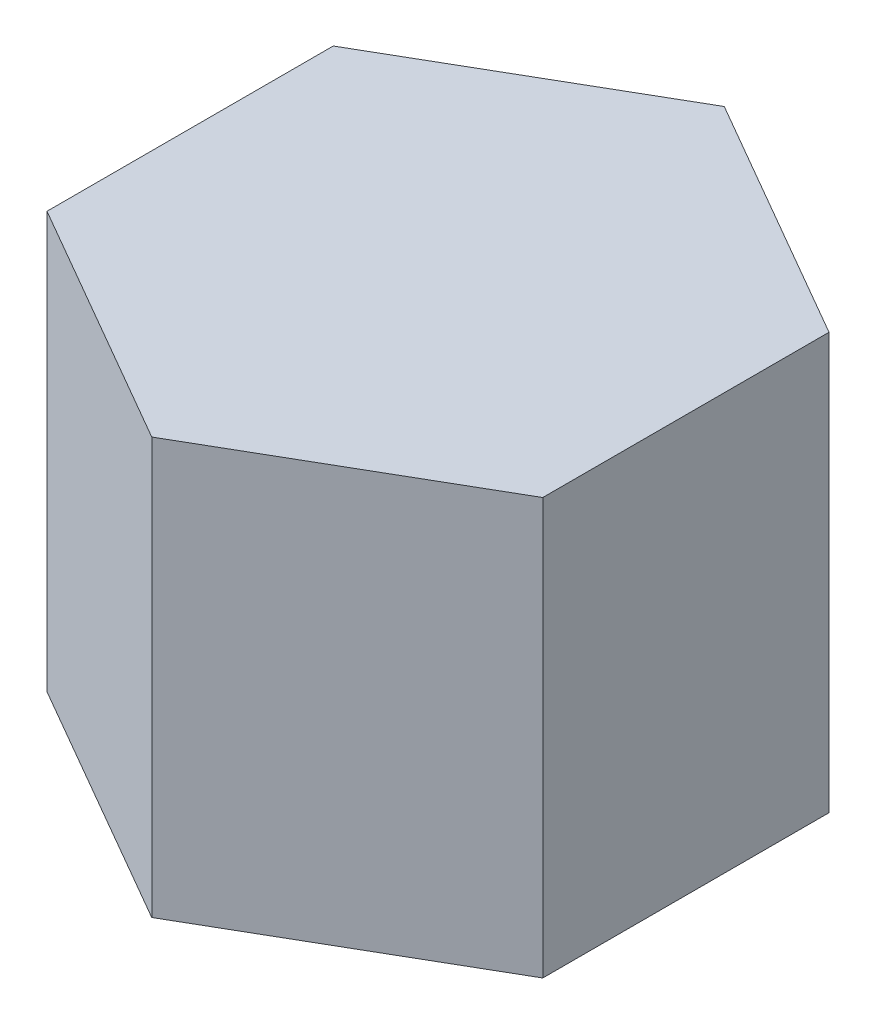
ISO-10303-21;
HEADER;
FILE_DESCRIPTION(('STEP AP214'),'2;1');
FILE_NAME('part.step','',(''),(''),'','','');
FILE_SCHEMA(('AUTOMOTIVE_DESIGN { 1 0 10303 214 1 1 1 1 }'));
ENDSEC;
DATA;
#1=APPLICATION_CONTEXT('core data for automotive mechanical design processes');
#2=APPLICATION_PROTOCOL_DEFINITION('international standard','automotive_design',2000,#1);
#3=PRODUCT_CONTEXT('',#1,'mechanical');
#4=PRODUCT('Part','Part','',(#3));
#5=PRODUCT_RELATED_PRODUCT_CATEGORY('part','',(#4));
#6=PRODUCT_DEFINITION_FORMATION('','',#4);
#7=PRODUCT_DEFINITION_CONTEXT('part definition',#1,'design');
#8=PRODUCT_DEFINITION('design','',#6,#7);
#9=PRODUCT_DEFINITION_SHAPE('','',#8);
#10=(LENGTH_UNIT() NAMED_UNIT(*) SI_UNIT(.MILLI.,.METRE.));
#11=(NAMED_UNIT(*) PLANE_ANGLE_UNIT() SI_UNIT($,.RADIAN.));
#12=(NAMED_UNIT(*) SI_UNIT($,.STERADIAN.) SOLID_ANGLE_UNIT());
#13=UNCERTAINTY_MEASURE_WITH_UNIT(LENGTH_MEASURE(1.E-05),#10,'distance_accuracy_value','');
#14=(GEOMETRIC_REPRESENTATION_CONTEXT(3) GLOBAL_UNCERTAINTY_ASSIGNED_CONTEXT((#13)) GLOBAL_UNIT_ASSIGNED_CONTEXT((#10,
#11,#12)) REPRESENTATION_CONTEXT('',''));
#15=CARTESIAN_POINT('',(0.,0.,0.));
#16=DIRECTION('',(0.,0.,1.));
#17=DIRECTION('',(1.,0.,0.));
#18=AXIS2_PLACEMENT_3D('',#15,#16,#17);
#19=CARTESIAN_POINT('',(207.839551417381,-147.556598747966,296.012098239417));
#20=DIRECTION('',(-0.500000000000062,0.,-0.866025403784403));
#21=DIRECTION('',(-0.866025403784403,0.,0.500000000000062));
#22=AXIS2_PLACEMENT_3D('',#19,#20,#21);
#23=PLANE('',#22);
#24=CARTESIAN_POINT('',(208.142660308706,-147.047793579175,295.837098239417));
#25=DIRECTION('',(-0.866025403784403,0.,0.500000000000062));
#26=VECTOR('',#25,1.);
#27=LINE('',#24,#26);
#28=CARTESIAN_POINT('',(208.142660308706,-147.047793579175,295.837098239417));
#29=VERTEX_POINT('',#28);
#30=CARTESIAN_POINT('',(207.839551417382,-147.047793579175,296.012098239417));
#31=VERTEX_POINT('',#30);
#32=EDGE_CURVE('E170',#29,#31,#27,.T.);
#33=ORIENTED_EDGE('',*,*,#32,.T.);
#34=CARTESIAN_POINT('',(207.839551417382,-147.556598747966,296.012098239417));
#35=DIRECTION('',(0.,1.,0.));
#36=VECTOR('',#35,1.);
#37=LINE('',#34,#36);
#38=CARTESIAN_POINT('',(207.839551417382,-147.556598747966,296.012098239417));
#39=VERTEX_POINT('',#38);
#40=EDGE_CURVE('E35',#39,#31,#37,.T.);
#41=ORIENTED_EDGE('',*,*,#40,.F.);
#42=CARTESIAN_POINT('',(208.142660308706,-147.556598747966,295.837098239417));
#43=DIRECTION('',(-0.866025403784403,0.,0.500000000000062));
#44=VECTOR('',#43,1.);
#45=LINE('',#42,#44);
#46=CARTESIAN_POINT('',(208.142660308706,-147.556598747966,295.837098239417));
#47=VERTEX_POINT('',#46);
#48=EDGE_CURVE('E159',#47,#39,#45,.T.);
#49=ORIENTED_EDGE('',*,*,#48,.F.);
#50=CARTESIAN_POINT('',(208.142660308706,-147.556598747966,295.837098239417));
#51=DIRECTION('',(0.,1.,0.));
#52=VECTOR('',#51,1.);
#53=LINE('',#50,#52);
#54=EDGE_CURVE('E10',#47,#29,#53,.T.);
#55=ORIENTED_EDGE('',*,*,#54,.T.);
#56=EDGE_LOOP('',(#33,#41,#49,#55));
#57=FACE_BOUND('',#56,.T.);
#58=ADVANCED_FACE('F16',(#57),#23,.F.);
#59=CARTESIAN_POINT('',(208.142660308706,-147.556598747966,291.594471220494));
#60=DIRECTION('',(-1.,0.,0.));
#61=DIRECTION('',(0.,-1.,0.));
#62=AXIS2_PLACEMENT_3D('',#59,#60,#61);
#63=PLANE('',#62);
#64=CARTESIAN_POINT('',(208.142660308706,-147.047793579175,295.487098239417));
#65=DIRECTION('',(0.,0.,1.));
#66=VECTOR('',#65,1.);
#67=LINE('',#64,#66);
#68=CARTESIAN_POINT('',(208.142660308706,-147.047793579175,295.487098239417));
#69=VERTEX_POINT('',#68);
#70=EDGE_CURVE('E167',#69,#29,#67,.T.);
#71=ORIENTED_EDGE('',*,*,#70,.T.);
#72=ORIENTED_EDGE('',*,*,#54,.F.);
#73=CARTESIAN_POINT('',(208.142660308706,-147.556598747966,295.487098239417));
#74=DIRECTION('',(0.,0.,1.));
#75=VECTOR('',#74,1.);
#76=LINE('',#73,#75);
#77=CARTESIAN_POINT('',(208.142660308706,-147.556598747966,295.487098239417));
#78=VERTEX_POINT('',#77);
#79=EDGE_CURVE('E156',#78,#47,#76,.T.);
#80=ORIENTED_EDGE('',*,*,#79,.F.);
#81=CARTESIAN_POINT('',(208.142660308706,-147.556598747966,295.487098239417));
#82=DIRECTION('',(0.,1.,0.));
#83=VECTOR('',#82,1.);
#84=LINE('',#81,#83);
#85=EDGE_CURVE('E27',#78,#69,#84,.T.);
#86=ORIENTED_EDGE('',*,*,#85,.T.);
#87=EDGE_LOOP('',(#71,#72,#80,#86));
#88=FACE_BOUND('',#87,.T.);
#89=ADVANCED_FACE('F189',(#88),#63,.F.);
#90=CARTESIAN_POINT('',(208.142660308706,-147.556598747966,295.487098239417));
#91=DIRECTION('',(-0.500000000000012,0.,0.866025403784432));
#92=DIRECTION('',(0.866025403784432,0.,0.500000000000012));
#93=AXIS2_PLACEMENT_3D('',#90,#91,#92);
#94=PLANE('',#93);
#95=CARTESIAN_POINT('',(207.839551417382,-147.047793579175,295.312098239417));
#96=DIRECTION('',(0.866025403784432,0.,0.500000000000012));
#97=VECTOR('',#96,1.);
#98=LINE('',#95,#97);
#99=CARTESIAN_POINT('',(207.839551417382,-147.047793579175,295.312098239417));
#100=VERTEX_POINT('',#99);
#101=EDGE_CURVE('E163',#100,#69,#98,.T.);
#102=ORIENTED_EDGE('',*,*,#101,.T.);
#103=ORIENTED_EDGE('',*,*,#85,.F.);
#104=CARTESIAN_POINT('',(207.839551417382,-147.556598747966,295.312098239417));
#105=DIRECTION('',(0.866025403784432,0.,0.500000000000012));
#106=VECTOR('',#105,1.);
#107=LINE('',#104,#106);
#108=CARTESIAN_POINT('',(207.839551417382,-147.556598747966,295.312098239417));
#109=VERTEX_POINT('',#108);
#110=EDGE_CURVE('E106',#109,#78,#107,.T.);
#111=ORIENTED_EDGE('',*,*,#110,.F.);
#112=CARTESIAN_POINT('',(207.839551417382,-147.556598747966,295.312098239417));
#113=DIRECTION('',(0.,1.,0.));
#114=VECTOR('',#113,1.);
#115=LINE('',#112,#114);
#116=EDGE_CURVE('E94',#109,#100,#115,.T.);
#117=ORIENTED_EDGE('',*,*,#116,.T.);
#118=EDGE_LOOP('',(#102,#103,#111,#117));
#119=FACE_BOUND('',#118,.T.);
#120=ADVANCED_FACE('F198',(#119),#94,.F.);
#121=CARTESIAN_POINT('',(207.839551417382,-147.556598747966,295.312098239417));
#122=DIRECTION('',(0.499999999999978,0.,0.866025403784452));
#123=DIRECTION('',(0.866025403784452,0.,-0.499999999999978));
#124=AXIS2_PLACEMENT_3D('',#121,#122,#123);
#125=PLANE('',#124);
#126=CARTESIAN_POINT('',(207.536442526057,-147.047793579175,295.487098239417));
#127=DIRECTION('',(0.866025403784452,0.,-0.499999999999978));
#128=VECTOR('',#127,1.);
#129=LINE('',#126,#128);
#130=CARTESIAN_POINT('',(207.536442526057,-147.047793579175,295.487098239417));
#131=VERTEX_POINT('',#130);
#132=EDGE_CURVE('E162',#131,#100,#129,.T.);
#133=ORIENTED_EDGE('',*,*,#132,.T.);
#134=ORIENTED_EDGE('',*,*,#116,.F.);
#135=CARTESIAN_POINT('',(207.536442526057,-147.556598747966,295.487098239417));
#136=DIRECTION('',(0.866025403784452,0.,-0.499999999999978));
#137=VECTOR('',#136,1.);
#138=LINE('',#135,#137);
#139=CARTESIAN_POINT('',(207.536442526057,-147.556598747966,295.487098239417));
#140=VERTEX_POINT('',#139);
#141=EDGE_CURVE('E98',#140,#109,#138,.T.);
#142=ORIENTED_EDGE('',*,*,#141,.F.);
#143=CARTESIAN_POINT('',(207.536442526057,-147.556598747966,295.487098239417));
#144=DIRECTION('',(0.,1.,0.));
#145=VECTOR('',#144,1.);
#146=LINE('',#143,#145);
#147=EDGE_CURVE('E79',#140,#131,#146,.T.);
#148=ORIENTED_EDGE('',*,*,#147,.T.);
#149=EDGE_LOOP('',(#133,#134,#142,#148));
#150=FACE_BOUND('',#149,.T.);
#151=ADVANCED_FACE('F100',(#150),#125,.F.);
#152=CARTESIAN_POINT('',(207.536442526057,-147.556598747966,291.594471220494));
#153=DIRECTION('',(1.,0.,0.));
#154=DIRECTION('',(0.,1.,0.));
#155=AXIS2_PLACEMENT_3D('',#152,#153,#154);
#156=PLANE('',#155);
#157=CARTESIAN_POINT('',(207.536442526057,-147.047793579175,295.837098239417));
#158=DIRECTION('',(0.,0.,-1.));
#159=VECTOR('',#158,1.);
#160=LINE('',#157,#159);
#161=CARTESIAN_POINT('',(207.536442526057,-147.047793579175,295.837098239417));
#162=VERTEX_POINT('',#161);
#163=EDGE_CURVE('E88',#162,#131,#160,.T.);
#164=ORIENTED_EDGE('',*,*,#163,.T.);
#165=ORIENTED_EDGE('',*,*,#147,.F.);
#166=CARTESIAN_POINT('',(207.536442526057,-147.556598747966,295.837098239417));
#167=DIRECTION('',(0.,0.,-1.));
#168=VECTOR('',#167,1.);
#169=LINE('',#166,#168);
#170=CARTESIAN_POINT('',(207.536442526057,-147.556598747966,295.837098239417));
#171=VERTEX_POINT('',#170);
#172=EDGE_CURVE('E84',#171,#140,#169,.T.);
#173=ORIENTED_EDGE('',*,*,#172,.F.);
#174=CARTESIAN_POINT('',(207.536442526057,-147.556598747966,295.837098239417));
#175=DIRECTION('',(0.,1.,0.));
#176=VECTOR('',#175,1.);
#177=LINE('',#174,#176);
#178=EDGE_CURVE('E58',#171,#162,#177,.T.);
#179=ORIENTED_EDGE('',*,*,#178,.T.);
#180=EDGE_LOOP('',(#164,#165,#173,#179));
#181=FACE_BOUND('',#180,.T.);
#182=ADVANCED_FACE('F82',(#181),#156,.F.);
#183=CARTESIAN_POINT('',(207.536442526057,-147.556598747966,295.837098239417));
#184=DIRECTION('',(0.500000000000062,0.,-0.866025403784403));
#185=DIRECTION('',(-0.866025403784403,0.,-0.500000000000062));
#186=AXIS2_PLACEMENT_3D('',#183,#184,#185);
#187=PLANE('',#186);
#188=CARTESIAN_POINT('',(207.839551417382,-147.047793579175,296.012098239417));
#189=DIRECTION('',(-0.866025403784403,0.,-0.500000000000062));
#190=VECTOR('',#189,1.);
#191=LINE('',#188,#190);
#192=EDGE_CURVE('E160',#31,#162,#191,.T.);
#193=ORIENTED_EDGE('',*,*,#192,.T.);
#194=ORIENTED_EDGE('',*,*,#178,.F.);
#195=CARTESIAN_POINT('',(207.839551417382,-147.556598747966,296.012098239417));
#196=DIRECTION('',(-0.866025403784403,0.,-0.500000000000062));
#197=VECTOR('',#196,1.);
#198=LINE('',#195,#197);
#199=EDGE_CURVE('E112',#39,#171,#198,.T.);
#200=ORIENTED_EDGE('',*,*,#199,.F.);
#201=ORIENTED_EDGE('',*,*,#40,.T.);
#202=EDGE_LOOP('',(#193,#194,#200,#201));
#203=FACE_BOUND('',#202,.T.);
#204=ADVANCED_FACE('F131',(#203),#187,.F.);
#205=CARTESIAN_POINT('',(206.491105863044,-147.556598747966,291.594471220494));
#206=DIRECTION('',(0.,1.,0.));
#207=DIRECTION('',(-1.,0.,0.));
#208=AXIS2_PLACEMENT_3D('',#205,#206,#207);
#209=PLANE('',#208);
#210=ORIENTED_EDGE('',*,*,#48,.T.);
#211=ORIENTED_EDGE('',*,*,#199,.T.);
#212=ORIENTED_EDGE('',*,*,#172,.T.);
#213=ORIENTED_EDGE('',*,*,#141,.T.);
#214=ORIENTED_EDGE('',*,*,#110,.T.);
#215=ORIENTED_EDGE('',*,*,#79,.T.);
#216=EDGE_LOOP('',(#210,#211,#212,#213,#214,#215));
#217=FACE_BOUND('',#216,.T.);
#218=ADVANCED_FACE('F111',(#217),#209,.F.);
#219=CARTESIAN_POINT('',(206.491105863044,-147.047793579175,291.594471220494));
#220=DIRECTION('',(0.,1.,0.));
#221=DIRECTION('',(-1.,0.,0.));
#222=AXIS2_PLACEMENT_3D('',#219,#220,#221);
#223=PLANE('',#222);
#224=ORIENTED_EDGE('',*,*,#32,.F.);
#225=ORIENTED_EDGE('',*,*,#70,.F.);
#226=ORIENTED_EDGE('',*,*,#101,.F.);
#227=ORIENTED_EDGE('',*,*,#132,.F.);
#228=ORIENTED_EDGE('',*,*,#163,.F.);
#229=ORIENTED_EDGE('',*,*,#192,.F.);
#230=EDGE_LOOP('',(#224,#225,#226,#227,#228,#229));
#231=FACE_BOUND('',#230,.T.);
#232=ADVANCED_FACE('F130',(#231),#223,.T.);
#233=CLOSED_SHELL('',(#58,#89,#120,#151,#182,#204,#218,#232));
#234=MANIFOLD_SOLID_BREP('B1',#233);
#235=ADVANCED_BREP_SHAPE_REPRESENTATION('',(#18,#234),#14);
#236=SHAPE_DEFINITION_REPRESENTATION(#9,#235);
ENDSEC;
END-ISO-10303-21;
